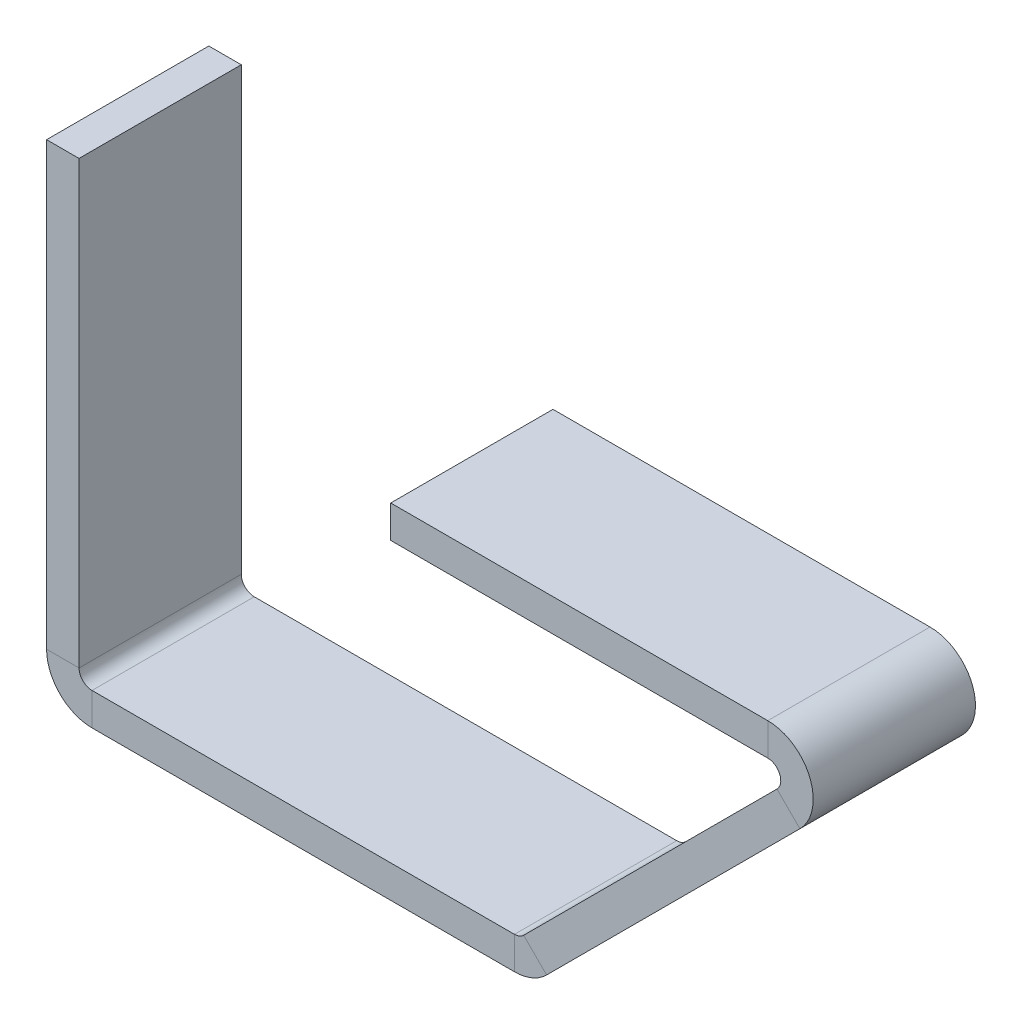
ISO-10303-21;
HEADER;
FILE_DESCRIPTION(('STEP AP214'),'2;1');
FILE_NAME('part.step','',(''),(''),'','','');
FILE_SCHEMA(('AUTOMOTIVE_DESIGN { 1 0 10303 214 1 1 1 1 }'));
ENDSEC;
DATA;
#1=APPLICATION_CONTEXT('core data for automotive mechanical design processes');
#2=APPLICATION_PROTOCOL_DEFINITION('international standard','automotive_design',2000,#1);
#3=PRODUCT_CONTEXT('',#1,'mechanical');
#4=PRODUCT('Part','Part','',(#3));
#5=PRODUCT_RELATED_PRODUCT_CATEGORY('part','',(#4));
#6=PRODUCT_DEFINITION_FORMATION('','',#4);
#7=PRODUCT_DEFINITION_CONTEXT('part definition',#1,'design');
#8=PRODUCT_DEFINITION('design','',#6,#7);
#9=PRODUCT_DEFINITION_SHAPE('','',#8);
#10=(LENGTH_UNIT() NAMED_UNIT(*) SI_UNIT(.MILLI.,.METRE.));
#11=(NAMED_UNIT(*) PLANE_ANGLE_UNIT() SI_UNIT($,.RADIAN.));
#12=(NAMED_UNIT(*) SI_UNIT($,.STERADIAN.) SOLID_ANGLE_UNIT());
#13=UNCERTAINTY_MEASURE_WITH_UNIT(LENGTH_MEASURE(1.E-05),#10,'distance_accuracy_value','');
#14=(GEOMETRIC_REPRESENTATION_CONTEXT(3) GLOBAL_UNCERTAINTY_ASSIGNED_CONTEXT((#13)) GLOBAL_UNIT_ASSIGNED_CONTEXT((#10,
#11,#12)) REPRESENTATION_CONTEXT('',''));
#15=CARTESIAN_POINT('',(0.,0.,0.));
#16=DIRECTION('',(0.,0.,1.));
#17=DIRECTION('',(1.,0.,0.));
#18=AXIS2_PLACEMENT_3D('',#15,#16,#17);
#19=CARTESIAN_POINT('',(-54.7219136914939,-5.42535434495538,10.));
#20=DIRECTION('',(0.,0.,1.));
#21=DIRECTION('',(1.,0.,0.));
#22=AXIS2_PLACEMENT_3D('',#19,#20,#21);
#23=PLANE('',#22);
#24=DIRECTION('',(1.,0.,0.));
#25=VECTOR('',#24,1.);
#26=CARTESIAN_POINT('',(-54.7219136914939,-5.42535434495538,10.));
#27=LINE('',#26,#25);
#28=CARTESIAN_POINT('',(-54.7219136914939,-5.42535434495538,10.));
#29=VERTEX_POINT('',#28);
#30=CARTESIAN_POINT('',(-52.7218736914939,-5.42535434495538,10.));
#31=VERTEX_POINT('',#30);
#32=EDGE_CURVE('E11',#29,#31,#27,.T.);
#33=ORIENTED_EDGE('',*,*,#32,.F.);
#34=CARTESIAN_POINT('',(-51.9218736914939,-5.42535434495538,10.));
#35=DIRECTION('',(0.,0.,-1.));
#36=DIRECTION('',(-1.,0.,0.));
#37=AXIS2_PLACEMENT_3D('',#34,#35,#36);
#38=CIRCLE('',#37,2.80004);
#39=CARTESIAN_POINT('',(-51.9218736914939,-8.22539434495538,10.));
#40=VERTEX_POINT('',#39);
#41=EDGE_CURVE('E308',#29,#40,#38,.F.);
#42=ORIENTED_EDGE('',*,*,#41,.T.);
#43=DIRECTION('',(0.,-1.,0.));
#44=VECTOR('',#43,1.);
#45=CARTESIAN_POINT('',(-51.9218736914939,-6.22535434495538,10.));
#46=LINE('',#45,#44);
#47=CARTESIAN_POINT('',(-51.9218736914939,-6.22535434495538,10.));
#48=VERTEX_POINT('',#47);
#49=EDGE_CURVE('E49',#48,#40,#46,.T.);
#50=ORIENTED_EDGE('',*,*,#49,.F.);
#51=CARTESIAN_POINT('',(-51.9218736914939,-5.42535434495538,10.));
#52=DIRECTION('',(0.,0.,1.));
#53=DIRECTION('',(1.,0.,0.));
#54=AXIS2_PLACEMENT_3D('',#51,#52,#53);
#55=CIRCLE('',#54,0.8);
#56=EDGE_CURVE('E327',#31,#48,#55,.T.);
#57=ORIENTED_EDGE('',*,*,#56,.F.);
#58=EDGE_LOOP('',(#33,#42,#50,#57));
#59=FACE_BOUND('',#58,.T.);
#60=ADVANCED_FACE('F41',(#59),#23,.T.);
#61=CARTESIAN_POINT('',(-51.9218736914939,-6.22535434495538,10.));
#62=DIRECTION('',(0.,0.,1.));
#63=DIRECTION('',(1.,0.,0.));
#64=AXIS2_PLACEMENT_3D('',#61,#62,#63);
#65=PLANE('',#64);
#66=DIRECTION('',(0.,-1.,0.));
#67=VECTOR('',#66,1.);
#68=CARTESIAN_POINT('',(-54.7219136914939,21.7746056550446,10.));
#69=LINE('',#68,#67);
#70=CARTESIAN_POINT('',(-54.7219136914939,21.7746056550446,10.));
#71=VERTEX_POINT('',#70);
#72=EDGE_CURVE('E312',#71,#29,#69,.T.);
#73=ORIENTED_EDGE('',*,*,#72,.T.);
#74=ORIENTED_EDGE('',*,*,#32,.T.);
#75=DIRECTION('',(0.,1.,0.));
#76=VECTOR('',#75,1.);
#77=CARTESIAN_POINT('',(-52.7218736914939,21.7746056550446,10.));
#78=LINE('',#77,#76);
#79=CARTESIAN_POINT('',(-52.7218736914939,21.7746056550446,10.));
#80=VERTEX_POINT('',#79);
#81=EDGE_CURVE('E324',#80,#31,#78,.F.);
#82=ORIENTED_EDGE('',*,*,#81,.F.);
#83=DIRECTION('',(1.,0.,0.));
#84=VECTOR('',#83,1.);
#85=CARTESIAN_POINT('',(-54.7219136914939,21.7746056550446,10.));
#86=LINE('',#85,#84);
#87=EDGE_CURVE('E321',#71,#80,#86,.T.);
#88=ORIENTED_EDGE('',*,*,#87,.F.);
#89=EDGE_LOOP('',(#73,#74,#82,#88));
#90=FACE_BOUND('',#89,.T.);
#91=ADVANCED_FACE('F377',(#90),#65,.T.);
#92=CARTESIAN_POINT('',(-51.9218736914939,-8.22539434495538,0.));
#93=DIRECTION('',(0.,0.,-1.));
#94=DIRECTION('',(-1.,0.,0.));
#95=AXIS2_PLACEMENT_3D('',#92,#93,#94);
#96=PLANE('',#95);
#97=DIRECTION('',(0.,1.,0.));
#98=VECTOR('',#97,1.);
#99=CARTESIAN_POINT('',(-51.9218736914939,-8.22539434495538,0.));
#100=LINE('',#99,#98);
#101=CARTESIAN_POINT('',(-51.9218736914939,-8.22539434495538,0.));
#102=VERTEX_POINT('',#101);
#103=CARTESIAN_POINT('',(-51.9218736914939,-6.22535434495538,0.));
#104=VERTEX_POINT('',#103);
#105=EDGE_CURVE('E294',#102,#104,#100,.T.);
#106=ORIENTED_EDGE('',*,*,#105,.F.);
#107=CARTESIAN_POINT('',(-51.9218736914939,-5.42535434495538,0.));
#108=DIRECTION('',(0.,0.,-1.));
#109=DIRECTION('',(-1.,0.,0.));
#110=AXIS2_PLACEMENT_3D('',#107,#108,#109);
#111=CIRCLE('',#110,2.80004);
#112=CARTESIAN_POINT('',(-54.7219136914939,-5.42535434495538,0.));
#113=VERTEX_POINT('',#112);
#114=EDGE_CURVE('E236',#113,#102,#111,.F.);
#115=ORIENTED_EDGE('',*,*,#114,.F.);
#116=DIRECTION('',(-1.,0.,0.));
#117=VECTOR('',#116,1.);
#118=CARTESIAN_POINT('',(-52.7218736914939,-5.42535434495538,0.));
#119=LINE('',#118,#117);
#120=CARTESIAN_POINT('',(-52.7218736914939,-5.42535434495538,0.));
#121=VERTEX_POINT('',#120);
#122=EDGE_CURVE('E292',#121,#113,#119,.T.);
#123=ORIENTED_EDGE('',*,*,#122,.F.);
#124=CARTESIAN_POINT('',(-51.9218736914939,-5.42535434495538,0.));
#125=DIRECTION('',(0.,0.,1.));
#126=DIRECTION('',(1.,0.,0.));
#127=AXIS2_PLACEMENT_3D('',#124,#125,#126);
#128=CIRCLE('',#127,0.8);
#129=EDGE_CURVE('E224',#121,#104,#128,.T.);
#130=ORIENTED_EDGE('',*,*,#129,.T.);
#131=EDGE_LOOP('',(#106,#115,#123,#130));
#132=FACE_BOUND('',#131,.T.);
#133=ADVANCED_FACE('F387',(#132),#96,.T.);
#134=CARTESIAN_POINT('',(-52.7218736914939,-5.42535434495538,0.));
#135=DIRECTION('',(0.,0.,-1.));
#136=DIRECTION('',(-1.,0.,0.));
#137=AXIS2_PLACEMENT_3D('',#134,#135,#136);
#138=PLANE('',#137);
#139=DIRECTION('',(1.,0.,0.));
#140=VECTOR('',#139,1.);
#141=CARTESIAN_POINT('',(-54.7219136914939,-8.22539434495538,0.));
#142=LINE('',#141,#140);
#143=CARTESIAN_POINT('',(-25.8817282346811,-8.22539434495539,0.));
#144=VERTEX_POINT('',#143);
#145=EDGE_CURVE('E239',#102,#144,#142,.T.);
#146=ORIENTED_EDGE('',*,*,#145,.F.);
#147=ORIENTED_EDGE('',*,*,#105,.T.);
#148=DIRECTION('',(1.,0.,0.));
#149=VECTOR('',#148,1.);
#150=CARTESIAN_POINT('',(-54.7219136914939,-6.22535434495538,0.));
#151=LINE('',#150,#149);
#152=CARTESIAN_POINT('',(-25.8817282346811,-6.22535434495539,0.));
#153=VERTEX_POINT('',#152);
#154=EDGE_CURVE('E221',#104,#153,#151,.T.);
#155=ORIENTED_EDGE('',*,*,#154,.T.);
#156=DIRECTION('',(0.,-1.,0.));
#157=VECTOR('',#156,1.);
#158=CARTESIAN_POINT('',(-25.8817282346811,-6.22535434495539,0.));
#159=LINE('',#158,#157);
#160=EDGE_CURVE('E288',#153,#144,#159,.T.);
#161=ORIENTED_EDGE('',*,*,#160,.T.);
#162=EDGE_LOOP('',(#146,#147,#155,#161));
#163=FACE_BOUND('',#162,.T.);
#164=ADVANCED_FACE('F389',(#163),#138,.T.);
#165=CARTESIAN_POINT('',(-25.8817282346811,-8.22539434495539,10.));
#166=DIRECTION('',(0.,0.,1.));
#167=DIRECTION('',(1.,0.,0.));
#168=AXIS2_PLACEMENT_3D('',#165,#166,#167);
#169=PLANE('',#168);
#170=DIRECTION('',(0.,1.,0.));
#171=VECTOR('',#170,1.);
#172=CARTESIAN_POINT('',(-25.8817282346811,-8.22539434495539,10.));
#173=LINE('',#172,#171);
#174=CARTESIAN_POINT('',(-25.8817282346811,-8.22539434495539,10.));
#175=VERTEX_POINT('',#174);
#176=CARTESIAN_POINT('',(-25.8817282346811,-6.22535434495539,10.));
#177=VERTEX_POINT('',#176);
#178=EDGE_CURVE('E174',#175,#177,#173,.T.);
#179=ORIENTED_EDGE('',*,*,#178,.F.);
#180=CARTESIAN_POINT('',(-25.8817282346811,-5.42535434495539,10.));
#181=DIRECTION('',(0.,0.,-1.));
#182=DIRECTION('',(-1.,0.,0.));
#183=AXIS2_PLACEMENT_3D('',#180,#181,#182);
#184=CIRCLE('',#183,2.80004);
#185=CARTESIAN_POINT('',(-23.9018009630875,-7.40528161654897,10.));
#186=VERTEX_POINT('',#185);
#187=EDGE_CURVE('E178',#175,#186,#184,.F.);
#188=ORIENTED_EDGE('',*,*,#187,.T.);
#189=DIRECTION('',(0.707106781186549,-0.707106781186546,0.));
#190=VECTOR('',#189,1.);
#191=CARTESIAN_POINT('',(-25.3160428097318,-5.99103976990463,10.));
#192=LINE('',#191,#190);
#193=CARTESIAN_POINT('',(-25.3160428097318,-5.99103976990463,10.));
#194=VERTEX_POINT('',#193);
#195=EDGE_CURVE('E162',#194,#186,#192,.T.);
#196=ORIENTED_EDGE('',*,*,#195,.F.);
#197=CARTESIAN_POINT('',(-25.8817282346811,-5.42535434495539,10.));
#198=DIRECTION('',(0.,0.,1.));
#199=DIRECTION('',(1.,0.,0.));
#200=AXIS2_PLACEMENT_3D('',#197,#198,#199);
#201=CIRCLE('',#200,0.8);
#202=EDGE_CURVE('E330',#177,#194,#201,.T.);
#203=ORIENTED_EDGE('',*,*,#202,.F.);
#204=EDGE_LOOP('',(#179,#188,#196,#203));
#205=FACE_BOUND('',#204,.T.);
#206=ADVANCED_FACE('F180',(#205),#169,.T.);
#207=CARTESIAN_POINT('',(-25.3160428097318,-5.99103976990463,10.));
#208=DIRECTION('',(0.,0.,1.));
#209=DIRECTION('',(1.,0.,0.));
#210=AXIS2_PLACEMENT_3D('',#207,#208,#209);
#211=PLANE('',#210);
#212=DIRECTION('',(1.,0.,0.));
#213=VECTOR('',#212,1.);
#214=CARTESIAN_POINT('',(-54.7219136914939,-8.22539434495538,10.));
#215=LINE('',#214,#213);
#216=EDGE_CURVE('E184',#40,#175,#215,.T.);
#217=ORIENTED_EDGE('',*,*,#216,.T.);
#218=ORIENTED_EDGE('',*,*,#178,.T.);
#219=DIRECTION('',(1.,0.,0.));
#220=VECTOR('',#219,1.);
#221=CARTESIAN_POINT('',(-54.7219136914939,-6.22535434495538,10.));
#222=LINE('',#221,#220);
#223=EDGE_CURVE('E302',#48,#177,#222,.T.);
#224=ORIENTED_EDGE('',*,*,#223,.F.);
#225=ORIENTED_EDGE('',*,*,#49,.T.);
#226=EDGE_LOOP('',(#217,#218,#224,#225));
#227=FACE_BOUND('',#226,.T.);
#228=ADVANCED_FACE('F298',(#227),#211,.T.);
#229=CARTESIAN_POINT('',(-23.9018009630875,-7.40528161654897,0.));
#230=DIRECTION('',(0.,0.,-1.));
#231=DIRECTION('',(-1.,0.,0.));
#232=AXIS2_PLACEMENT_3D('',#229,#230,#231);
#233=PLANE('',#232);
#234=DIRECTION('',(-0.707106781186549,0.707106781186546,0.));
#235=VECTOR('',#234,1.);
#236=CARTESIAN_POINT('',(-23.9018009630875,-7.40528161654897,0.));
#237=LINE('',#236,#235);
#238=CARTESIAN_POINT('',(-23.9018009630875,-7.40528161654897,0.));
#239=VERTEX_POINT('',#238);
#240=CARTESIAN_POINT('',(-25.3160428097318,-5.99103976990463,0.));
#241=VERTEX_POINT('',#240);
#242=EDGE_CURVE('E175',#239,#241,#237,.T.);
#243=ORIENTED_EDGE('',*,*,#242,.F.);
#244=CARTESIAN_POINT('',(-25.8817282346811,-5.42535434495539,0.));
#245=DIRECTION('',(0.,0.,-1.));
#246=DIRECTION('',(-1.,0.,0.));
#247=AXIS2_PLACEMENT_3D('',#244,#245,#246);
#248=CIRCLE('',#247,2.80004);
#249=EDGE_CURVE('E191',#144,#239,#248,.F.);
#250=ORIENTED_EDGE('',*,*,#249,.F.);
#251=ORIENTED_EDGE('',*,*,#160,.F.);
#252=CARTESIAN_POINT('',(-25.8817282346811,-5.42535434495539,0.));
#253=DIRECTION('',(0.,0.,1.));
#254=DIRECTION('',(1.,0.,0.));
#255=AXIS2_PLACEMENT_3D('',#252,#253,#254);
#256=CIRCLE('',#255,0.8);
#257=EDGE_CURVE('E218',#153,#241,#256,.T.);
#258=ORIENTED_EDGE('',*,*,#257,.T.);
#259=EDGE_LOOP('',(#243,#250,#251,#258));
#260=FACE_BOUND('',#259,.T.);
#261=ADVANCED_FACE('F391',(#260),#233,.T.);
#262=CARTESIAN_POINT('',(-25.8817282346811,-6.22535434495539,0.));
#263=DIRECTION('',(0.,0.,-1.));
#264=DIRECTION('',(-1.,0.,0.));
#265=AXIS2_PLACEMENT_3D('',#262,#263,#264);
#266=PLANE('',#265);
#267=DIRECTION('',(0.707106781186546,0.707106781186549,0.));
#268=VECTOR('',#267,1.);
#269=CARTESIAN_POINT('',(-24.7219136914939,-8.22539434495539,0.));
#270=LINE('',#269,#268);
#271=CARTESIAN_POINT('',(-8.28867752749113,8.20784181904746,0.));
#272=VERTEX_POINT('',#271);
#273=EDGE_CURVE('E243',#239,#272,#270,.T.);
#274=ORIENTED_EDGE('',*,*,#273,.F.);
#275=ORIENTED_EDGE('',*,*,#242,.T.);
#276=DIRECTION('',(0.707106781186546,0.707106781186549,0.));
#277=VECTOR('',#276,1.);
#278=CARTESIAN_POINT('',(-26.1361555381383,-6.81115249831105,0.));
#279=LINE('',#278,#277);
#280=CARTESIAN_POINT('',(-9.70291937413548,9.6220836656918,0.));
#281=VERTEX_POINT('',#280);
#282=EDGE_CURVE('E216',#241,#281,#279,.T.);
#283=ORIENTED_EDGE('',*,*,#282,.T.);
#284=DIRECTION('',(0.707106781186551,-0.707106781186544,0.));
#285=VECTOR('',#284,1.);
#286=CARTESIAN_POINT('',(-9.70291937413548,9.6220836656918,0.));
#287=LINE('',#286,#285);
#288=EDGE_CURVE('E110',#281,#272,#287,.T.);
#289=ORIENTED_EDGE('',*,*,#288,.T.);
#290=EDGE_LOOP('',(#274,#275,#283,#289));
#291=FACE_BOUND('',#290,.T.);
#292=ADVANCED_FACE('F392',(#291),#266,.T.);
#293=CARTESIAN_POINT('',(-8.28867752749113,8.20784181904746,10.));
#294=DIRECTION('',(0.,0.,1.));
#295=DIRECTION('',(1.,0.,0.));
#296=AXIS2_PLACEMENT_3D('',#293,#294,#295);
#297=PLANE('',#296);
#298=DIRECTION('',(-0.707106781186551,0.707106781186544,0.));
#299=VECTOR('',#298,1.);
#300=CARTESIAN_POINT('',(-8.28867752749113,8.20784181904746,10.));
#301=LINE('',#300,#299);
#302=CARTESIAN_POINT('',(-8.28867752749113,8.20784181904746,10.));
#303=VERTEX_POINT('',#302);
#304=CARTESIAN_POINT('',(-9.70291937413548,9.6220836656918,10.));
#305=VERTEX_POINT('',#304);
#306=EDGE_CURVE('E286',#303,#305,#301,.T.);
#307=ORIENTED_EDGE('',*,*,#306,.F.);
#308=CARTESIAN_POINT('',(-10.2686047990847,10.187769090641,10.));
#309=DIRECTION('',(0.,0.,-1.));
#310=DIRECTION('',(-1.,0.,0.));
#311=AXIS2_PLACEMENT_3D('',#308,#309,#310);
#312=CIRCLE('',#311,2.80004);
#313=CARTESIAN_POINT('',(-10.2686047990847,12.987809090641,10.));
#314=VERTEX_POINT('',#313);
#315=EDGE_CURVE('E199',#303,#314,#312,.F.);
#316=ORIENTED_EDGE('',*,*,#315,.T.);
#317=DIRECTION('',(0.,1.,0.));
#318=VECTOR('',#317,1.);
#319=CARTESIAN_POINT('',(-10.2686047990847,10.987769090641,10.));
#320=LINE('',#319,#318);
#321=CARTESIAN_POINT('',(-10.2686047990847,10.987769090641,10.));
#322=VERTEX_POINT('',#321);
#323=EDGE_CURVE('E57',#322,#314,#320,.T.);
#324=ORIENTED_EDGE('',*,*,#323,.F.);
#325=CARTESIAN_POINT('',(-10.2686047990847,10.187769090641,10.));
#326=DIRECTION('',(0.,0.,1.));
#327=DIRECTION('',(1.,0.,0.));
#328=AXIS2_PLACEMENT_3D('',#325,#326,#327);
#329=CIRCLE('',#328,0.8);
#330=EDGE_CURVE('E333',#305,#322,#329,.T.);
#331=ORIENTED_EDGE('',*,*,#330,.F.);
#332=EDGE_LOOP('',(#307,#316,#324,#331));
#333=FACE_BOUND('',#332,.T.);
#334=ADVANCED_FACE('F356',(#333),#297,.T.);
#335=CARTESIAN_POINT('',(-10.2686047990847,10.987769090641,10.));
#336=DIRECTION('',(0.,0.,1.));
#337=DIRECTION('',(1.,0.,0.));
#338=AXIS2_PLACEMENT_3D('',#335,#336,#337);
#339=PLANE('',#338);
#340=DIRECTION('',(0.707106781186546,0.707106781186549,0.));
#341=VECTOR('',#340,1.);
#342=CARTESIAN_POINT('',(-24.7219136914939,-8.22539434495539,10.));
#343=LINE('',#342,#341);
#344=EDGE_CURVE('E166',#186,#303,#343,.T.);
#345=ORIENTED_EDGE('',*,*,#344,.T.);
#346=ORIENTED_EDGE('',*,*,#306,.T.);
#347=DIRECTION('',(0.707106781186546,0.707106781186549,0.));
#348=VECTOR('',#347,1.);
#349=CARTESIAN_POINT('',(-26.1361555381383,-6.81115249831105,10.));
#350=LINE('',#349,#348);
#351=EDGE_CURVE('E169',#194,#305,#350,.T.);
#352=ORIENTED_EDGE('',*,*,#351,.F.);
#353=ORIENTED_EDGE('',*,*,#195,.T.);
#354=EDGE_LOOP('',(#345,#346,#352,#353));
#355=FACE_BOUND('',#354,.T.);
#356=ADVANCED_FACE('F164',(#355),#339,.T.);
#357=CARTESIAN_POINT('',(-10.2686047990847,12.987809090641,0.));
#358=DIRECTION('',(0.,0.,-1.));
#359=DIRECTION('',(-1.,0.,0.));
#360=AXIS2_PLACEMENT_3D('',#357,#358,#359);
#361=PLANE('',#360);
#362=DIRECTION('',(0.,-1.,0.));
#363=VECTOR('',#362,1.);
#364=CARTESIAN_POINT('',(-10.2686047990847,12.987809090641,0.));
#365=LINE('',#364,#363);
#366=CARTESIAN_POINT('',(-10.2686047990847,12.987809090641,0.));
#367=VERTEX_POINT('',#366);
#368=CARTESIAN_POINT('',(-10.2686047990847,10.987769090641,0.));
#369=VERTEX_POINT('',#368);
#370=EDGE_CURVE('E117',#367,#369,#365,.T.);
#371=ORIENTED_EDGE('',*,*,#370,.F.);
#372=CARTESIAN_POINT('',(-10.2686047990847,10.187769090641,0.));
#373=DIRECTION('',(0.,0.,-1.));
#374=DIRECTION('',(-1.,0.,0.));
#375=AXIS2_PLACEMENT_3D('',#372,#373,#374);
#376=CIRCLE('',#375,2.80004);
#377=EDGE_CURVE('E245',#272,#367,#376,.F.);
#378=ORIENTED_EDGE('',*,*,#377,.F.);
#379=ORIENTED_EDGE('',*,*,#288,.F.);
#380=CARTESIAN_POINT('',(-10.2686047990847,10.187769090641,0.));
#381=DIRECTION('',(0.,0.,1.));
#382=DIRECTION('',(1.,0.,0.));
#383=AXIS2_PLACEMENT_3D('',#380,#381,#382);
#384=CIRCLE('',#383,0.8);
#385=EDGE_CURVE('E214',#281,#369,#384,.T.);
#386=ORIENTED_EDGE('',*,*,#385,.T.);
#387=EDGE_LOOP('',(#371,#378,#379,#386));
#388=FACE_BOUND('',#387,.T.);
#389=ADVANCED_FACE('F396',(#388),#361,.T.);
#390=CARTESIAN_POINT('',(-9.70291937413548,9.6220836656918,0.));
#391=DIRECTION('',(0.,0.,-1.));
#392=DIRECTION('',(-1.,0.,0.));
#393=AXIS2_PLACEMENT_3D('',#390,#391,#392);
#394=PLANE('',#393);
#395=DIRECTION('',(-1.,0.,0.));
#396=VECTOR('',#395,1.);
#397=CARTESIAN_POINT('',(-3.50871025589753,12.9878090906411,0.));
#398=LINE('',#397,#396);
#399=CARTESIAN_POINT('',(-33.5087102558975,12.9878090906409,0.));
#400=VERTEX_POINT('',#399);
#401=EDGE_CURVE('E205',#367,#400,#398,.T.);
#402=ORIENTED_EDGE('',*,*,#401,.F.);
#403=ORIENTED_EDGE('',*,*,#370,.T.);
#404=DIRECTION('',(-1.,0.,0.));
#405=VECTOR('',#404,1.);
#406=CARTESIAN_POINT('',(-3.50871025589752,10.9877690906411,0.));
#407=LINE('',#406,#405);
#408=CARTESIAN_POINT('',(-33.5087102558975,10.9877690906409,0.));
#409=VERTEX_POINT('',#408);
#410=EDGE_CURVE('E211',#369,#409,#407,.T.);
#411=ORIENTED_EDGE('',*,*,#410,.T.);
#412=DIRECTION('',(0.,1.,0.));
#413=VECTOR('',#412,1.);
#414=CARTESIAN_POINT('',(-33.5087102558975,10.9877690906409,0.));
#415=LINE('',#414,#413);
#416=EDGE_CURVE('E208',#409,#400,#415,.T.);
#417=ORIENTED_EDGE('',*,*,#416,.T.);
#418=EDGE_LOOP('',(#402,#403,#411,#417));
#419=FACE_BOUND('',#418,.T.);
#420=ADVANCED_FACE('F398',(#419),#394,.T.);
#421=CARTESIAN_POINT('',(-3.50871025589753,12.9878090906411,10.));
#422=DIRECTION('',(0.,-1.,0.));
#423=DIRECTION('',(1.,0.,0.));
#424=AXIS2_PLACEMENT_3D('',#421,#422,#423);
#425=PLANE('',#424);
#426=ORIENTED_EDGE('',*,*,#401,.T.);
#427=DIRECTION('',(0.,0.,-1.));
#428=VECTOR('',#427,1.);
#429=CARTESIAN_POINT('',(-33.5087102558975,12.9878090906409,10.));
#430=LINE('',#429,#428);
#431=CARTESIAN_POINT('',(-33.5087102558975,12.9878090906409,10.));
#432=VERTEX_POINT('',#431);
#433=EDGE_CURVE('E281',#432,#400,#430,.T.);
#434=ORIENTED_EDGE('',*,*,#433,.F.);
#435=DIRECTION('',(-1.,0.,0.));
#436=VECTOR('',#435,1.);
#437=CARTESIAN_POINT('',(-3.50871025589753,12.9878090906411,10.));
#438=LINE('',#437,#436);
#439=EDGE_CURVE('E123',#314,#432,#438,.T.);
#440=ORIENTED_EDGE('',*,*,#439,.F.);
#441=DIRECTION('',(0.,0.,-1.));
#442=VECTOR('',#441,1.);
#443=CARTESIAN_POINT('',(-10.2686047990847,12.987809090641,10.));
#444=LINE('',#443,#442);
#445=EDGE_CURVE('E201',#314,#367,#444,.T.);
#446=ORIENTED_EDGE('',*,*,#445,.T.);
#447=EDGE_LOOP('',(#426,#434,#440,#446));
#448=FACE_BOUND('',#447,.T.);
#449=ADVANCED_FACE('F404',(#448),#425,.F.);
#450=CARTESIAN_POINT('',(-33.5087102558975,10.9877690906409,10.));
#451=DIRECTION('',(-1.,0.,0.));
#452=DIRECTION('',(0.,-1.,0.));
#453=AXIS2_PLACEMENT_3D('',#450,#451,#452);
#454=PLANE('',#453);
#455=ORIENTED_EDGE('',*,*,#416,.F.);
#456=DIRECTION('',(0.,0.,-1.));
#457=VECTOR('',#456,1.);
#458=CARTESIAN_POINT('',(-33.5087102558975,10.9877690906409,10.));
#459=LINE('',#458,#457);
#460=CARTESIAN_POINT('',(-33.5087102558975,10.9877690906409,10.));
#461=VERTEX_POINT('',#460);
#462=EDGE_CURVE('E279',#461,#409,#459,.T.);
#463=ORIENTED_EDGE('',*,*,#462,.F.);
#464=DIRECTION('',(0.,1.,0.));
#465=VECTOR('',#464,1.);
#466=CARTESIAN_POINT('',(-33.5087102558975,10.9877690906409,10.));
#467=LINE('',#466,#465);
#468=EDGE_CURVE('E339',#461,#432,#467,.T.);
#469=ORIENTED_EDGE('',*,*,#468,.T.);
#470=ORIENTED_EDGE('',*,*,#433,.T.);
#471=EDGE_LOOP('',(#455,#463,#469,#470));
#472=FACE_BOUND('',#471,.T.);
#473=ADVANCED_FACE('F344',(#472),#454,.T.);
#474=CARTESIAN_POINT('',(-3.50871025589752,10.9877690906411,10.));
#475=DIRECTION('',(0.,-1.,0.));
#476=DIRECTION('',(1.,0.,0.));
#477=AXIS2_PLACEMENT_3D('',#474,#475,#476);
#478=PLANE('',#477);
#479=ORIENTED_EDGE('',*,*,#410,.F.);
#480=DIRECTION('',(0.,0.,-1.));
#481=VECTOR('',#480,1.);
#482=CARTESIAN_POINT('',(-10.2686047990847,10.987769090641,10.));
#483=LINE('',#482,#481);
#484=EDGE_CURVE('E276',#322,#369,#483,.T.);
#485=ORIENTED_EDGE('',*,*,#484,.F.);
#486=DIRECTION('',(-1.,0.,0.));
#487=VECTOR('',#486,1.);
#488=CARTESIAN_POINT('',(-3.50871025589752,10.9877690906411,10.));
#489=LINE('',#488,#487);
#490=EDGE_CURVE('E336',#322,#461,#489,.T.);
#491=ORIENTED_EDGE('',*,*,#490,.T.);
#492=ORIENTED_EDGE('',*,*,#462,.T.);
#493=EDGE_LOOP('',(#479,#485,#491,#492));
#494=FACE_BOUND('',#493,.T.);
#495=ADVANCED_FACE('F349',(#494),#478,.T.);
#496=CARTESIAN_POINT('',(-10.2686047990847,10.187769090641,10.));
#497=DIRECTION('',(0.,0.,-1.));
#498=DIRECTION('',(-1.,0.,0.));
#499=AXIS2_PLACEMENT_3D('',#496,#497,#498);
#500=CYLINDRICAL_SURFACE('',#499,0.8);
#501=ORIENTED_EDGE('',*,*,#385,.F.);
#502=DIRECTION('',(0.,0.,-1.));
#503=VECTOR('',#502,1.);
#504=CARTESIAN_POINT('',(-9.70291937413548,9.6220836656918,10.));
#505=LINE('',#504,#503);
#506=EDGE_CURVE('E273',#305,#281,#505,.T.);
#507=ORIENTED_EDGE('',*,*,#506,.F.);
#508=ORIENTED_EDGE('',*,*,#330,.T.);
#509=ORIENTED_EDGE('',*,*,#484,.T.);
#510=EDGE_LOOP('',(#501,#507,#508,#509));
#511=FACE_BOUND('',#510,.T.);
#512=ADVANCED_FACE('F352',(#511),#500,.F.);
#513=CARTESIAN_POINT('',(-26.1361555381383,-6.81115249831105,10.));
#514=DIRECTION('',(-0.707106781186549,0.707106781186546,0.));
#515=DIRECTION('',(-0.707106781186546,-0.707106781186549,0.));
#516=AXIS2_PLACEMENT_3D('',#513,#514,#515);
#517=PLANE('',#516);
#518=ORIENTED_EDGE('',*,*,#282,.F.);
#519=DIRECTION('',(0.,0.,-1.));
#520=VECTOR('',#519,1.);
#521=CARTESIAN_POINT('',(-25.3160428097318,-5.99103976990463,10.));
#522=LINE('',#521,#520);
#523=EDGE_CURVE('E270',#194,#241,#522,.T.);
#524=ORIENTED_EDGE('',*,*,#523,.F.);
#525=ORIENTED_EDGE('',*,*,#351,.T.);
#526=ORIENTED_EDGE('',*,*,#506,.T.);
#527=EDGE_LOOP('',(#518,#524,#525,#526));
#528=FACE_BOUND('',#527,.T.);
#529=ADVANCED_FACE('F359',(#528),#517,.T.);
#530=CARTESIAN_POINT('',(-25.8817282346811,-5.42535434495539,10.));
#531=DIRECTION('',(0.,0.,-1.));
#532=DIRECTION('',(-1.,0.,0.));
#533=AXIS2_PLACEMENT_3D('',#530,#531,#532);
#534=CYLINDRICAL_SURFACE('',#533,0.8);
#535=ORIENTED_EDGE('',*,*,#257,.F.);
#536=DIRECTION('',(0.,0.,-1.));
#537=VECTOR('',#536,1.);
#538=CARTESIAN_POINT('',(-25.8817282346811,-6.22535434495539,10.));
#539=LINE('',#538,#537);
#540=EDGE_CURVE('E267',#177,#153,#539,.T.);
#541=ORIENTED_EDGE('',*,*,#540,.F.);
#542=ORIENTED_EDGE('',*,*,#202,.T.);
#543=ORIENTED_EDGE('',*,*,#523,.T.);
#544=EDGE_LOOP('',(#535,#541,#542,#543));
#545=FACE_BOUND('',#544,.T.);
#546=ADVANCED_FACE('F362',(#545),#534,.F.);
#547=CARTESIAN_POINT('',(-54.7219136914939,-6.22535434495538,10.));
#548=DIRECTION('',(0.,1.,0.));
#549=DIRECTION('',(-1.,0.,0.));
#550=AXIS2_PLACEMENT_3D('',#547,#548,#549);
#551=PLANE('',#550);
#552=ORIENTED_EDGE('',*,*,#154,.F.);
#553=DIRECTION('',(0.,0.,-1.));
#554=VECTOR('',#553,1.);
#555=CARTESIAN_POINT('',(-51.9218736914939,-6.22535434495538,10.));
#556=LINE('',#555,#554);
#557=EDGE_CURVE('E264',#48,#104,#556,.T.);
#558=ORIENTED_EDGE('',*,*,#557,.F.);
#559=ORIENTED_EDGE('',*,*,#223,.T.);
#560=ORIENTED_EDGE('',*,*,#540,.T.);
#561=EDGE_LOOP('',(#552,#558,#559,#560));
#562=FACE_BOUND('',#561,.T.);
#563=ADVANCED_FACE('F366',(#562),#551,.T.);
#564=CARTESIAN_POINT('',(-51.9218736914939,-5.42535434495538,10.));
#565=DIRECTION('',(0.,0.,-1.));
#566=DIRECTION('',(-1.,0.,0.));
#567=AXIS2_PLACEMENT_3D('',#564,#565,#566);
#568=CYLINDRICAL_SURFACE('',#567,0.8);
#569=ORIENTED_EDGE('',*,*,#129,.F.);
#570=DIRECTION('',(0.,0.,-1.));
#571=VECTOR('',#570,1.);
#572=CARTESIAN_POINT('',(-52.7218736914939,-5.42535434495538,10.));
#573=LINE('',#572,#571);
#574=EDGE_CURVE('E261',#31,#121,#573,.T.);
#575=ORIENTED_EDGE('',*,*,#574,.F.);
#576=ORIENTED_EDGE('',*,*,#56,.T.);
#577=ORIENTED_EDGE('',*,*,#557,.T.);
#578=EDGE_LOOP('',(#569,#575,#576,#577));
#579=FACE_BOUND('',#578,.T.);
#580=ADVANCED_FACE('F369',(#579),#568,.F.);
#581=CARTESIAN_POINT('',(-52.7218736914939,21.7746056550446,10.));
#582=DIRECTION('',(1.,0.,0.));
#583=DIRECTION('',(0.,0.,-1.));
#584=AXIS2_PLACEMENT_3D('',#581,#582,#583);
#585=PLANE('',#584);
#586=DIRECTION('',(0.,1.,0.));
#587=VECTOR('',#586,1.);
#588=CARTESIAN_POINT('',(-52.7218736914939,21.7746056550446,0.));
#589=LINE('',#588,#587);
#590=CARTESIAN_POINT('',(-52.7218736914939,21.7746056550446,0.));
#591=VERTEX_POINT('',#590);
#592=EDGE_CURVE('E227',#591,#121,#589,.F.);
#593=ORIENTED_EDGE('',*,*,#592,.F.);
#594=DIRECTION('',(0.,0.,-1.));
#595=VECTOR('',#594,1.);
#596=CARTESIAN_POINT('',(-52.7218736914939,21.7746056550446,10.));
#597=LINE('',#596,#595);
#598=EDGE_CURVE('E259',#80,#591,#597,.T.);
#599=ORIENTED_EDGE('',*,*,#598,.F.);
#600=ORIENTED_EDGE('',*,*,#81,.T.);
#601=ORIENTED_EDGE('',*,*,#574,.T.);
#602=EDGE_LOOP('',(#593,#599,#600,#601));
#603=FACE_BOUND('',#602,.T.);
#604=ADVANCED_FACE('F374',(#603),#585,.T.);
#605=CARTESIAN_POINT('',(-54.7219136914939,21.7746056550446,10.));
#606=DIRECTION('',(0.,1.,0.));
#607=DIRECTION('',(0.,0.,1.));
#608=AXIS2_PLACEMENT_3D('',#605,#606,#607);
#609=PLANE('',#608);
#610=DIRECTION('',(1.,0.,0.));
#611=VECTOR('',#610,1.);
#612=CARTESIAN_POINT('',(-54.7219136914939,21.7746056550446,0.));
#613=LINE('',#612,#611);
#614=CARTESIAN_POINT('',(-54.7219136914939,21.7746056550446,0.));
#615=VERTEX_POINT('',#614);
#616=EDGE_CURVE('E230',#615,#591,#613,.T.);
#617=ORIENTED_EDGE('',*,*,#616,.F.);
#618=DIRECTION('',(0.,0.,-1.));
#619=VECTOR('',#618,1.);
#620=CARTESIAN_POINT('',(-54.7219136914939,21.7746056550446,10.));
#621=LINE('',#620,#619);
#622=EDGE_CURVE('E257',#71,#615,#621,.T.);
#623=ORIENTED_EDGE('',*,*,#622,.F.);
#624=ORIENTED_EDGE('',*,*,#87,.T.);
#625=ORIENTED_EDGE('',*,*,#598,.T.);
#626=EDGE_LOOP('',(#617,#623,#624,#625));
#627=FACE_BOUND('',#626,.T.);
#628=ADVANCED_FACE('F380',(#627),#609,.T.);
#629=CARTESIAN_POINT('',(-54.7219136914939,21.7746056550446,10.));
#630=DIRECTION('',(1.,0.,0.));
#631=DIRECTION('',(0.,0.,-1.));
#632=AXIS2_PLACEMENT_3D('',#629,#630,#631);
#633=PLANE('',#632);
#634=DIRECTION('',(0.,-1.,0.));
#635=VECTOR('',#634,1.);
#636=CARTESIAN_POINT('',(-54.7219136914939,21.7746056550446,0.));
#637=LINE('',#636,#635);
#638=EDGE_CURVE('E233',#615,#113,#637,.T.);
#639=ORIENTED_EDGE('',*,*,#638,.T.);
#640=DIRECTION('',(0.,0.,-1.));
#641=VECTOR('',#640,1.);
#642=CARTESIAN_POINT('',(-54.7219136914939,-5.42535434495538,10.));
#643=LINE('',#642,#641);
#644=EDGE_CURVE('E254',#29,#113,#643,.T.);
#645=ORIENTED_EDGE('',*,*,#644,.F.);
#646=ORIENTED_EDGE('',*,*,#72,.F.);
#647=ORIENTED_EDGE('',*,*,#622,.T.);
#648=EDGE_LOOP('',(#639,#645,#646,#647));
#649=FACE_BOUND('',#648,.T.);
#650=ADVANCED_FACE('F385',(#649),#633,.F.);
#651=CARTESIAN_POINT('',(-51.9218736914939,-5.42535434495538,10.));
#652=DIRECTION('',(0.,0.,-1.));
#653=DIRECTION('',(-1.,0.,0.));
#654=AXIS2_PLACEMENT_3D('',#651,#652,#653);
#655=CYLINDRICAL_SURFACE('',#654,2.80004);
#656=ORIENTED_EDGE('',*,*,#114,.T.);
#657=DIRECTION('',(0.,0.,-1.));
#658=VECTOR('',#657,1.);
#659=CARTESIAN_POINT('',(-51.9218736914939,-8.22539434495538,10.));
#660=LINE('',#659,#658);
#661=EDGE_CURVE('E251',#40,#102,#660,.T.);
#662=ORIENTED_EDGE('',*,*,#661,.F.);
#663=ORIENTED_EDGE('',*,*,#41,.F.);
#664=ORIENTED_EDGE('',*,*,#644,.T.);
#665=EDGE_LOOP('',(#656,#662,#663,#664));
#666=FACE_BOUND('',#665,.T.);
#667=ADVANCED_FACE('F314',(#666),#655,.T.);
#668=CARTESIAN_POINT('',(-54.7219136914939,-8.22539434495538,10.));
#669=DIRECTION('',(0.,1.,0.));
#670=DIRECTION('',(-1.,0.,0.));
#671=AXIS2_PLACEMENT_3D('',#668,#669,#670);
#672=PLANE('',#671);
#673=ORIENTED_EDGE('',*,*,#145,.T.);
#674=DIRECTION('',(0.,0.,-1.));
#675=VECTOR('',#674,1.);
#676=CARTESIAN_POINT('',(-25.8817282346811,-8.22539434495539,10.));
#677=LINE('',#676,#675);
#678=EDGE_CURVE('E193',#175,#144,#677,.T.);
#679=ORIENTED_EDGE('',*,*,#678,.F.);
#680=ORIENTED_EDGE('',*,*,#216,.F.);
#681=ORIENTED_EDGE('',*,*,#661,.T.);
#682=EDGE_LOOP('',(#673,#679,#680,#681));
#683=FACE_BOUND('',#682,.T.);
#684=ADVANCED_FACE('F318',(#683),#672,.F.);
#685=CARTESIAN_POINT('',(-25.8817282346811,-5.42535434495539,10.));
#686=DIRECTION('',(0.,0.,-1.));
#687=DIRECTION('',(-1.,0.,0.));
#688=AXIS2_PLACEMENT_3D('',#685,#686,#687);
#689=CYLINDRICAL_SURFACE('',#688,2.80004);
#690=ORIENTED_EDGE('',*,*,#249,.T.);
#691=DIRECTION('',(0.,0.,-1.));
#692=VECTOR('',#691,1.);
#693=CARTESIAN_POINT('',(-23.9018009630875,-7.40528161654897,10.));
#694=LINE('',#693,#692);
#695=EDGE_CURVE('E188',#186,#239,#694,.T.);
#696=ORIENTED_EDGE('',*,*,#695,.F.);
#697=ORIENTED_EDGE('',*,*,#187,.F.);
#698=ORIENTED_EDGE('',*,*,#678,.T.);
#699=EDGE_LOOP('',(#690,#696,#697,#698));
#700=FACE_BOUND('',#699,.T.);
#701=ADVANCED_FACE('F189',(#700),#689,.T.);
#702=CARTESIAN_POINT('',(-24.7219136914939,-8.22539434495539,10.));
#703=DIRECTION('',(-0.707106781186549,0.707106781186546,0.));
#704=DIRECTION('',(-0.707106781186546,-0.707106781186549,0.));
#705=AXIS2_PLACEMENT_3D('',#702,#703,#704);
#706=PLANE('',#705);
#707=ORIENTED_EDGE('',*,*,#273,.T.);
#708=DIRECTION('',(0.,0.,-1.));
#709=VECTOR('',#708,1.);
#710=CARTESIAN_POINT('',(-8.28867752749113,8.20784181904746,10.));
#711=LINE('',#710,#709);
#712=EDGE_CURVE('E194',#303,#272,#711,.T.);
#713=ORIENTED_EDGE('',*,*,#712,.F.);
#714=ORIENTED_EDGE('',*,*,#344,.F.);
#715=ORIENTED_EDGE('',*,*,#695,.T.);
#716=EDGE_LOOP('',(#707,#713,#714,#715));
#717=FACE_BOUND('',#716,.T.);
#718=ADVANCED_FACE('F196',(#717),#706,.F.);
#719=CARTESIAN_POINT('',(-10.2686047990847,10.187769090641,10.));
#720=DIRECTION('',(0.,0.,-1.));
#721=DIRECTION('',(-1.,0.,0.));
#722=AXIS2_PLACEMENT_3D('',#719,#720,#721);
#723=CYLINDRICAL_SURFACE('',#722,2.80004);
#724=ORIENTED_EDGE('',*,*,#377,.T.);
#725=ORIENTED_EDGE('',*,*,#445,.F.);
#726=ORIENTED_EDGE('',*,*,#315,.F.);
#727=ORIENTED_EDGE('',*,*,#712,.T.);
#728=EDGE_LOOP('',(#724,#725,#726,#727));
#729=FACE_BOUND('',#728,.T.);
#730=ADVANCED_FACE('F394',(#729),#723,.T.);
#731=CARTESIAN_POINT('',(-10.2686047990847,10.187769090641,10.));
#732=DIRECTION('',(0.,0.,1.));
#733=DIRECTION('',(1.,0.,0.));
#734=AXIS2_PLACEMENT_3D('',#731,#732,#733);
#735=PLANE('',#734);
#736=ORIENTED_EDGE('',*,*,#439,.T.);
#737=ORIENTED_EDGE('',*,*,#468,.F.);
#738=ORIENTED_EDGE('',*,*,#490,.F.);
#739=ORIENTED_EDGE('',*,*,#323,.T.);
#740=EDGE_LOOP('',(#736,#737,#738,#739));
#741=FACE_BOUND('',#740,.T.);
#742=ADVANCED_FACE('F345',(#741),#735,.T.);
#743=CARTESIAN_POINT('',(-10.2686047990847,10.187769090641,0.));
#744=DIRECTION('',(0.,0.,1.));
#745=DIRECTION('',(1.,0.,0.));
#746=AXIS2_PLACEMENT_3D('',#743,#744,#745);
#747=PLANE('',#746);
#748=ORIENTED_EDGE('',*,*,#592,.T.);
#749=ORIENTED_EDGE('',*,*,#122,.T.);
#750=ORIENTED_EDGE('',*,*,#638,.F.);
#751=ORIENTED_EDGE('',*,*,#616,.T.);
#752=EDGE_LOOP('',(#748,#749,#750,#751));
#753=FACE_BOUND('',#752,.T.);
#754=ADVANCED_FACE('F603',(#753),#747,.F.);
#755=CLOSED_SHELL('',(#60,#91,#133,#164,#206,#228,#261,#292,#334,#356,#389,#420,#449,#473,#495,
#512,#529,#546,#563,#580,#604,#628,#650,#667,#684,#701,#718,#730,#742,#754));
#756=MANIFOLD_SOLID_BREP('B2',#755);
#757=ADVANCED_BREP_SHAPE_REPRESENTATION('',(#18,#756),#14);
#758=SHAPE_DEFINITION_REPRESENTATION(#9,#757);
ENDSEC;
END-ISO-10303-21;
